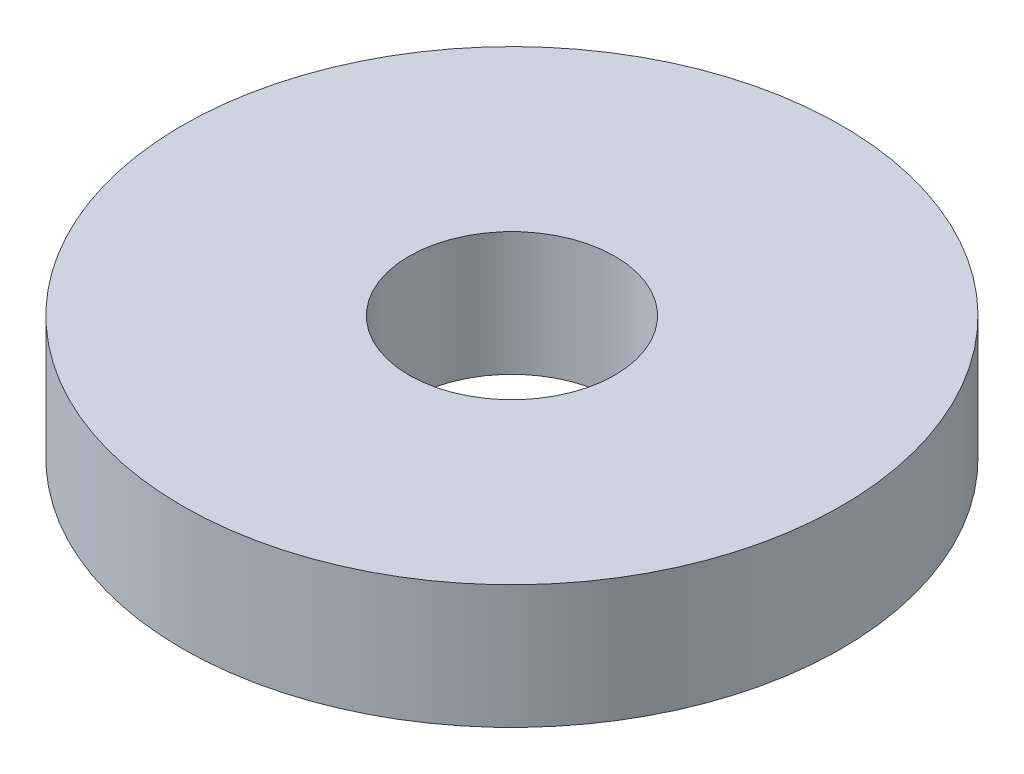
ISO-10303-21;
HEADER;
FILE_DESCRIPTION(('STEP AP214'),'2;1');
FILE_NAME('part.step','',(''),(''),'','','');
FILE_SCHEMA(('AUTOMOTIVE_DESIGN { 1 0 10303 214 1 1 1 1 }'));
ENDSEC;
DATA;
#1=APPLICATION_CONTEXT('core data for automotive mechanical design processes');
#2=APPLICATION_PROTOCOL_DEFINITION('international standard','automotive_design',2000,#1);
#3=PRODUCT_CONTEXT('',#1,'mechanical');
#4=PRODUCT('Part','Part','',(#3));
#5=PRODUCT_RELATED_PRODUCT_CATEGORY('part','',(#4));
#6=PRODUCT_DEFINITION_FORMATION('','',#4);
#7=PRODUCT_DEFINITION_CONTEXT('part definition',#1,'design');
#8=PRODUCT_DEFINITION('design','',#6,#7);
#9=PRODUCT_DEFINITION_SHAPE('','',#8);
#10=(LENGTH_UNIT() NAMED_UNIT(*) SI_UNIT(.MILLI.,.METRE.));
#11=(NAMED_UNIT(*) PLANE_ANGLE_UNIT() SI_UNIT($,.RADIAN.));
#12=(NAMED_UNIT(*) SI_UNIT($,.STERADIAN.) SOLID_ANGLE_UNIT());
#13=UNCERTAINTY_MEASURE_WITH_UNIT(LENGTH_MEASURE(1.E-05),#10,'distance_accuracy_value','');
#14=(GEOMETRIC_REPRESENTATION_CONTEXT(3) GLOBAL_UNCERTAINTY_ASSIGNED_CONTEXT((#13)) GLOBAL_UNIT_ASSIGNED_CONTEXT((#10,
#11,#12)) REPRESENTATION_CONTEXT('',''));
#15=CARTESIAN_POINT('',(0.,0.,0.));
#16=DIRECTION('',(0.,0.,1.));
#17=DIRECTION('',(1.,0.,0.));
#18=AXIS2_PLACEMENT_3D('',#15,#16,#17);
#19=CARTESIAN_POINT('',(0.,3.81,0.));
#20=DIRECTION('',(0.,1.,0.));
#21=DIRECTION('',(0.,0.,1.));
#22=AXIS2_PLACEMENT_3D('',#19,#20,#21);
#23=PLANE('',#22);
#24=CARTESIAN_POINT('',(0.,3.81,0.));
#25=DIRECTION('',(0.,1.,0.));
#26=DIRECTION('',(0.,0.,1.));
#27=AXIS2_PLACEMENT_3D('',#24,#25,#26);
#28=CIRCLE('',#27,10.16);
#29=CARTESIAN_POINT('',(0.,3.81,10.16));
#30=VERTEX_POINT('',#29);
#31=EDGE_CURVE('E10',#30,#30,#28,.T.);
#32=ORIENTED_EDGE('',*,*,#31,.T.);
#33=EDGE_LOOP('',(#32));
#34=FACE_BOUND('',#33,.T.);
#35=CARTESIAN_POINT('',(0.,3.81,0.));
#36=DIRECTION('',(0.,1.,0.));
#37=DIRECTION('',(0.,0.,1.));
#38=AXIS2_PLACEMENT_3D('',#35,#36,#37);
#39=CIRCLE('',#38,3.175);
#40=CARTESIAN_POINT('',(0.,3.81,3.175));
#41=VERTEX_POINT('',#40);
#42=EDGE_CURVE('E42',#41,#41,#39,.T.);
#43=ORIENTED_EDGE('',*,*,#42,.F.);
#44=EDGE_LOOP('',(#43));
#45=FACE_BOUND('',#44,.T.);
#46=ADVANCED_FACE('F31',(#34,#45),#23,.T.);
#47=CARTESIAN_POINT('',(0.,0.,0.));
#48=DIRECTION('',(0.,1.,0.));
#49=DIRECTION('',(0.,0.,1.));
#50=AXIS2_PLACEMENT_3D('',#47,#48,#49);
#51=PLANE('',#50);
#52=CARTESIAN_POINT('',(0.,0.,0.));
#53=DIRECTION('',(0.,1.,0.));
#54=DIRECTION('',(0.,0.,1.));
#55=AXIS2_PLACEMENT_3D('',#52,#53,#54);
#56=CIRCLE('',#55,10.16);
#57=CARTESIAN_POINT('',(0.,0.,10.16));
#58=VERTEX_POINT('',#57);
#59=EDGE_CURVE('E35',#58,#58,#56,.T.);
#60=ORIENTED_EDGE('',*,*,#59,.F.);
#61=EDGE_LOOP('',(#60));
#62=FACE_BOUND('',#61,.T.);
#63=CARTESIAN_POINT('',(0.,0.,0.));
#64=DIRECTION('',(0.,1.,0.));
#65=DIRECTION('',(0.,0.,1.));
#66=AXIS2_PLACEMENT_3D('',#63,#64,#65);
#67=CIRCLE('',#66,3.175);
#68=CARTESIAN_POINT('',(0.,0.,3.175));
#69=VERTEX_POINT('',#68);
#70=EDGE_CURVE('E44',#69,#69,#67,.T.);
#71=ORIENTED_EDGE('',*,*,#70,.T.);
#72=EDGE_LOOP('',(#71));
#73=FACE_BOUND('',#72,.T.);
#74=ADVANCED_FACE('F54',(#62,#73),#51,.F.);
#75=CARTESIAN_POINT('',(0.,3.81,0.));
#76=DIRECTION('',(0.,-1.,0.));
#77=DIRECTION('',(0.,0.,-1.));
#78=AXIS2_PLACEMENT_3D('',#75,#76,#77);
#79=CYLINDRICAL_SURFACE('',#78,10.16);
#80=ORIENTED_EDGE('',*,*,#31,.F.);
#81=EDGE_LOOP('',(#80));
#82=FACE_BOUND('',#81,.T.);
#83=ORIENTED_EDGE('',*,*,#59,.T.);
#84=EDGE_LOOP('',(#83));
#85=FACE_BOUND('',#84,.T.);
#86=ADVANCED_FACE('F33',(#82,#85),#79,.T.);
#87=CARTESIAN_POINT('',(0.,3.81,0.));
#88=DIRECTION('',(0.,-1.,0.));
#89=DIRECTION('',(0.,0.,-1.));
#90=AXIS2_PLACEMENT_3D('',#87,#88,#89);
#91=CYLINDRICAL_SURFACE('',#90,3.175);
#92=ORIENTED_EDGE('',*,*,#42,.T.);
#93=EDGE_LOOP('',(#92));
#94=FACE_BOUND('',#93,.T.);
#95=ORIENTED_EDGE('',*,*,#70,.F.);
#96=EDGE_LOOP('',(#95));
#97=FACE_BOUND('',#96,.T.);
#98=ADVANCED_FACE('F50',(#94,#97),#91,.F.);
#99=CLOSED_SHELL('',(#46,#74,#86,#98));
#100=MANIFOLD_SOLID_BREP('B2',#99);
#101=ADVANCED_BREP_SHAPE_REPRESENTATION('',(#18,#100),#14);
#102=SHAPE_DEFINITION_REPRESENTATION(#9,#101);
ENDSEC;
END-ISO-10303-21;
